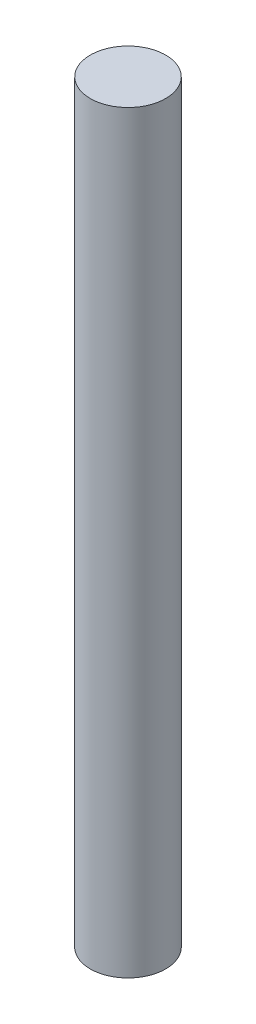
ISO-10303-21;
HEADER;
FILE_DESCRIPTION(('STEP AP214'),'2;1');
FILE_NAME('part.step','',(''),(''),'','','');
FILE_SCHEMA(('AUTOMOTIVE_DESIGN { 1 0 10303 214 1 1 1 1 }'));
ENDSEC;
DATA;
#1=APPLICATION_CONTEXT('core data for automotive mechanical design processes');
#2=APPLICATION_PROTOCOL_DEFINITION('international standard','automotive_design',2000,#1);
#3=PRODUCT_CONTEXT('',#1,'mechanical');
#4=PRODUCT('Part','Part','',(#3));
#5=PRODUCT_RELATED_PRODUCT_CATEGORY('part','',(#4));
#6=PRODUCT_DEFINITION_FORMATION('','',#4);
#7=PRODUCT_DEFINITION_CONTEXT('part definition',#1,'design');
#8=PRODUCT_DEFINITION('design','',#6,#7);
#9=PRODUCT_DEFINITION_SHAPE('','',#8);
#10=(LENGTH_UNIT() NAMED_UNIT(*) SI_UNIT(.MILLI.,.METRE.));
#11=(NAMED_UNIT(*) PLANE_ANGLE_UNIT() SI_UNIT($,.RADIAN.));
#12=(NAMED_UNIT(*) SI_UNIT($,.STERADIAN.) SOLID_ANGLE_UNIT());
#13=UNCERTAINTY_MEASURE_WITH_UNIT(LENGTH_MEASURE(1.E-05),#10,'distance_accuracy_value','');
#14=(GEOMETRIC_REPRESENTATION_CONTEXT(3) GLOBAL_UNCERTAINTY_ASSIGNED_CONTEXT((#13)) GLOBAL_UNIT_ASSIGNED_CONTEXT((#10,
#11,#12)) REPRESENTATION_CONTEXT('',''));
#15=CARTESIAN_POINT('',(0.,0.,0.));
#16=DIRECTION('',(0.,0.,1.));
#17=DIRECTION('',(1.,0.,0.));
#18=AXIS2_PLACEMENT_3D('',#15,#16,#17);
#19=CARTESIAN_POINT('',(0.,50.,0.));
#20=DIRECTION('',(0.,-1.,0.));
#21=DIRECTION('',(0.,0.,-1.));
#22=AXIS2_PLACEMENT_3D('',#19,#20,#21);
#23=CYLINDRICAL_SURFACE('',#22,2.5);
#24=CARTESIAN_POINT('',(0.,50.,0.));
#25=DIRECTION('',(0.,1.,0.));
#26=DIRECTION('',(0.,0.,1.));
#27=AXIS2_PLACEMENT_3D('',#24,#25,#26);
#28=CIRCLE('',#27,2.5);
#29=CARTESIAN_POINT('',(0.,50.,2.5));
#30=VERTEX_POINT('',#29);
#31=EDGE_CURVE('E10',#30,#30,#28,.T.);
#32=ORIENTED_EDGE('',*,*,#31,.F.);
#33=EDGE_LOOP('',(#32));
#34=FACE_BOUND('',#33,.T.);
#35=CARTESIAN_POINT('',(0.,0.,0.));
#36=DIRECTION('',(0.,1.,0.));
#37=DIRECTION('',(0.,0.,1.));
#38=AXIS2_PLACEMENT_3D('',#35,#36,#37);
#39=CIRCLE('',#38,2.5);
#40=CARTESIAN_POINT('',(0.,0.,2.5));
#41=VERTEX_POINT('',#40);
#42=EDGE_CURVE('E38',#41,#41,#39,.T.);
#43=ORIENTED_EDGE('',*,*,#42,.T.);
#44=EDGE_LOOP('',(#43));
#45=FACE_BOUND('',#44,.T.);
#46=ADVANCED_FACE('F35',(#34,#45),#23,.T.);
#47=CARTESIAN_POINT('',(0.,50.,0.));
#48=DIRECTION('',(0.,1.,0.));
#49=DIRECTION('',(0.,0.,1.));
#50=AXIS2_PLACEMENT_3D('',#47,#48,#49);
#51=PLANE('',#50);
#52=ORIENTED_EDGE('',*,*,#31,.T.);
#53=EDGE_LOOP('',(#52));
#54=FACE_BOUND('',#53,.T.);
#55=ADVANCED_FACE('F50',(#54),#51,.T.);
#56=CARTESIAN_POINT('',(0.,0.,0.));
#57=DIRECTION('',(0.,1.,0.));
#58=DIRECTION('',(0.,0.,1.));
#59=AXIS2_PLACEMENT_3D('',#56,#57,#58);
#60=PLANE('',#59);
#61=ORIENTED_EDGE('',*,*,#42,.F.);
#62=EDGE_LOOP('',(#61));
#63=FACE_BOUND('',#62,.T.);
#64=ADVANCED_FACE('F48',(#63),#60,.F.);
#65=CLOSED_SHELL('',(#46,#55,#64));
#66=MANIFOLD_SOLID_BREP('B2',#65);
#67=ADVANCED_BREP_SHAPE_REPRESENTATION('',(#18,#66),#14);
#68=SHAPE_DEFINITION_REPRESENTATION(#9,#67);
ENDSEC;
END-ISO-10303-21;
